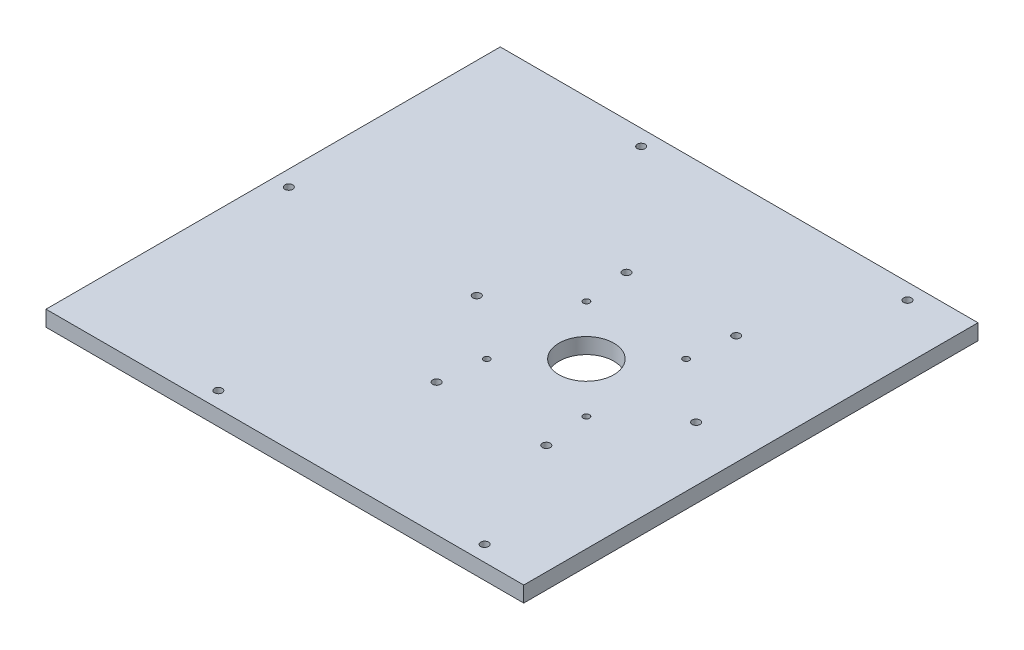
ISO-10303-21;
HEADER;
FILE_DESCRIPTION(('STEP AP214'),'2;1');
FILE_NAME('part.step','',(''),(''),'','','');
FILE_SCHEMA(('AUTOMOTIVE_DESIGN { 1 0 10303 214 1 1 1 1 }'));
ENDSEC;
DATA;
#1=APPLICATION_CONTEXT('core data for automotive mechanical design processes');
#2=APPLICATION_PROTOCOL_DEFINITION('international standard','automotive_design',2000,#1);
#3=PRODUCT_CONTEXT('',#1,'mechanical');
#4=PRODUCT('Part','Part','',(#3));
#5=PRODUCT_RELATED_PRODUCT_CATEGORY('part','',(#4));
#6=PRODUCT_DEFINITION_FORMATION('','',#4);
#7=PRODUCT_DEFINITION_CONTEXT('part definition',#1,'design');
#8=PRODUCT_DEFINITION('design','',#6,#7);
#9=PRODUCT_DEFINITION_SHAPE('','',#8);
#10=(LENGTH_UNIT() NAMED_UNIT(*) SI_UNIT(.MILLI.,.METRE.));
#11=(NAMED_UNIT(*) PLANE_ANGLE_UNIT() SI_UNIT($,.RADIAN.));
#12=(NAMED_UNIT(*) SI_UNIT($,.STERADIAN.) SOLID_ANGLE_UNIT());
#13=UNCERTAINTY_MEASURE_WITH_UNIT(LENGTH_MEASURE(1.E-05),#10,'distance_accuracy_value','');
#14=(GEOMETRIC_REPRESENTATION_CONTEXT(3) GLOBAL_UNCERTAINTY_ASSIGNED_CONTEXT((#13)) GLOBAL_UNIT_ASSIGNED_CONTEXT((#10,
#11,#12)) REPRESENTATION_CONTEXT('',''));
#15=CARTESIAN_POINT('',(0.,0.,0.));
#16=DIRECTION('',(0.,0.,1.));
#17=DIRECTION('',(1.,0.,0.));
#18=AXIS2_PLACEMENT_3D('',#15,#16,#17);
#19=CARTESIAN_POINT('',(0.,10.,0.));
#20=DIRECTION('',(0.,1.,0.));
#21=DIRECTION('',(0.,0.,1.));
#22=AXIS2_PLACEMENT_3D('',#19,#20,#21);
#23=PLANE('',#22);
#24=CARTESIAN_POINT('',(-9.99999999999931,10.,-60.6217782649111));
#25=DIRECTION('',(0.,1.,0.));
#26=DIRECTION('',(0.,0.,1.));
#27=AXIS2_PLACEMENT_3D('',#24,#25,#26);
#28=CIRCLE('',#27,2.50000000000001);
#29=CARTESIAN_POINT('',(-9.99999999999931,10.,-58.1217782649111));
#30=VERTEX_POINT('',#29);
#31=EDGE_CURVE('E193',#30,#30,#28,.T.);
#32=ORIENTED_EDGE('',*,*,#31,.F.);
#33=EDGE_LOOP('',(#32));
#34=FACE_BOUND('',#33,.T.);
#35=CARTESIAN_POINT('',(-75.,10.,-135.));
#36=DIRECTION('',(0.,1.,0.));
#37=DIRECTION('',(0.,0.,1.));
#38=AXIS2_PLACEMENT_3D('',#35,#36,#37);
#39=CIRCLE('',#38,2.5);
#40=CARTESIAN_POINT('',(-75.,10.,-132.5));
#41=VERTEX_POINT('',#40);
#42=EDGE_CURVE('E181',#41,#41,#39,.T.);
#43=ORIENTED_EDGE('',*,*,#42,.F.);
#44=EDGE_LOOP('',(#43));
#45=FACE_BOUND('',#44,.T.);
#46=CARTESIAN_POINT('',(95.0000000000001,10.,135.));
#47=DIRECTION('',(0.,1.,0.));
#48=DIRECTION('',(0.,0.,1.));
#49=AXIS2_PLACEMENT_3D('',#46,#47,#48);
#50=CIRCLE('',#49,2.5);
#51=CARTESIAN_POINT('',(95.0000000000001,10.,137.5));
#52=VERTEX_POINT('',#51);
#53=EDGE_CURVE('E169',#52,#52,#50,.T.);
#54=ORIENTED_EDGE('',*,*,#53,.F.);
#55=EDGE_LOOP('',(#54));
#56=FACE_BOUND('',#55,.T.);
#57=CARTESIAN_POINT('',(-165.,10.,0.));
#58=DIRECTION('',(0.,1.,0.));
#59=DIRECTION('',(0.,0.,1.));
#60=AXIS2_PLACEMENT_3D('',#57,#58,#59);
#61=CIRCLE('',#60,2.5);
#62=CARTESIAN_POINT('',(-165.,10.,2.5));
#63=VERTEX_POINT('',#62);
#64=EDGE_CURVE('E157',#63,#63,#61,.T.);
#65=ORIENTED_EDGE('',*,*,#64,.F.);
#66=EDGE_LOOP('',(#65));
#67=FACE_BOUND('',#66,.T.);
#68=CARTESIAN_POINT('',(-6.81980515339375,10.,31.8198051533952));
#69=DIRECTION('',(0.,1.,0.));
#70=DIRECTION('',(0.,0.,1.));
#71=AXIS2_PLACEMENT_3D('',#68,#69,#70);
#72=CIRCLE('',#71,2.00000000000001);
#73=CARTESIAN_POINT('',(-6.81980515339375,10.,33.8198051533953));
#74=VERTEX_POINT('',#73);
#75=EDGE_CURVE('E145',#74,#74,#72,.T.);
#76=ORIENTED_EDGE('',*,*,#75,.F.);
#77=EDGE_LOOP('',(#76));
#78=FACE_BOUND('',#77,.T.);
#79=CARTESIAN_POINT('',(-10.0000000000002,10.,60.6217782649106));
#80=DIRECTION('',(0.,1.,0.));
#81=DIRECTION('',(0.,0.,1.));
#82=AXIS2_PLACEMENT_3D('',#79,#80,#81);
#83=CIRCLE('',#82,2.50000000000002);
#84=CARTESIAN_POINT('',(-10.0000000000002,10.,63.1217782649106));
#85=VERTEX_POINT('',#84);
#86=EDGE_CURVE('E133',#85,#85,#83,.T.);
#87=ORIENTED_EDGE('',*,*,#86,.F.);
#88=EDGE_LOOP('',(#87));
#89=FACE_BOUND('',#88,.T.);
#90=CARTESIAN_POINT('',(56.8198051533947,10.,-31.8198051533946));
#91=DIRECTION('',(0.,1.,0.));
#92=DIRECTION('',(0.,0.,1.));
#93=AXIS2_PLACEMENT_3D('',#90,#91,#92);
#94=CIRCLE('',#93,2.00000000000001);
#95=CARTESIAN_POINT('',(56.8198051533947,10.,-29.8198051533946));
#96=VERTEX_POINT('',#95);
#97=EDGE_CURVE('E121',#96,#96,#94,.T.);
#98=ORIENTED_EDGE('',*,*,#97,.F.);
#99=EDGE_LOOP('',(#98));
#100=FACE_BOUND('',#99,.T.);
#101=CARTESIAN_POINT('',(25.0000000000001,10.,0.));
#102=DIRECTION('',(0.,1.,0.));
#103=DIRECTION('',(0.,0.,1.));
#104=AXIS2_PLACEMENT_3D('',#101,#102,#103);
#105=CIRCLE('',#104,17.5);
#106=CARTESIAN_POINT('',(25.0000000000001,10.,17.5));
#107=VERTEX_POINT('',#106);
#108=EDGE_CURVE('E100',#107,#107,#105,.T.);
#109=ORIENTED_EDGE('',*,*,#108,.F.);
#110=EDGE_LOOP('',(#109));
#111=FACE_BOUND('',#110,.T.);
#112=DIRECTION('',(0.,0.,1.));
#113=VECTOR('',#112,1.);
#114=CARTESIAN_POINT('',(-175.,10.,-145.));
#115=LINE('',#114,#113);
#116=CARTESIAN_POINT('',(-175.,10.,-145.));
#117=VERTEX_POINT('',#116);
#118=CARTESIAN_POINT('',(-175.,10.,145.));
#119=VERTEX_POINT('',#118);
#120=EDGE_CURVE('E85',#117,#119,#115,.T.);
#121=ORIENTED_EDGE('',*,*,#120,.T.);
#122=DIRECTION('',(1.,0.,0.));
#123=VECTOR('',#122,1.);
#124=CARTESIAN_POINT('',(-175.,10.,145.));
#125=LINE('',#124,#123);
#126=CARTESIAN_POINT('',(130.,10.,145.));
#127=VERTEX_POINT('',#126);
#128=EDGE_CURVE('E80',#119,#127,#125,.T.);
#129=ORIENTED_EDGE('',*,*,#128,.T.);
#130=DIRECTION('',(0.,0.,-1.));
#131=VECTOR('',#130,1.);
#132=CARTESIAN_POINT('',(130.,10.,-145.));
#133=LINE('',#132,#131);
#134=CARTESIAN_POINT('',(130.,10.,-145.));
#135=VERTEX_POINT('',#134);
#136=EDGE_CURVE('E83',#127,#135,#133,.T.);
#137=ORIENTED_EDGE('',*,*,#136,.T.);
#138=DIRECTION('',(-1.,0.,0.));
#139=VECTOR('',#138,1.);
#140=CARTESIAN_POINT('',(-175.,10.,-145.));
#141=LINE('',#140,#139);
#142=EDGE_CURVE('E50',#135,#117,#141,.T.);
#143=ORIENTED_EDGE('',*,*,#142,.T.);
#144=EDGE_LOOP('',(#121,#129,#137,#143));
#145=FACE_BOUND('',#144,.T.);
#146=CARTESIAN_POINT('',(95.0000000000002,10.,0.));
#147=DIRECTION('',(0.,1.,0.));
#148=DIRECTION('',(0.,0.,1.));
#149=AXIS2_PLACEMENT_3D('',#146,#147,#148);
#150=CIRCLE('',#149,2.50000000000001);
#151=CARTESIAN_POINT('',(95.0000000000002,10.,2.50000000000001));
#152=VERTEX_POINT('',#151);
#153=EDGE_CURVE('E115',#152,#152,#150,.T.);
#154=ORIENTED_EDGE('',*,*,#153,.F.);
#155=EDGE_LOOP('',(#154));
#156=FACE_BOUND('',#155,.T.);
#157=CARTESIAN_POINT('',(60.,10.,60.6217782649108));
#158=DIRECTION('',(0.,1.,0.));
#159=DIRECTION('',(0.,0.,1.));
#160=AXIS2_PLACEMENT_3D('',#157,#158,#159);
#161=CIRCLE('',#160,2.5);
#162=CARTESIAN_POINT('',(60.,10.,63.1217782649108));
#163=VERTEX_POINT('',#162);
#164=EDGE_CURVE('E127',#163,#163,#161,.T.);
#165=ORIENTED_EDGE('',*,*,#164,.F.);
#166=EDGE_LOOP('',(#165));
#167=FACE_BOUND('',#166,.T.);
#168=CARTESIAN_POINT('',(56.8198051533955,10.,31.8198051533947));
#169=DIRECTION('',(0.,1.,0.));
#170=DIRECTION('',(0.,0.,1.));
#171=AXIS2_PLACEMENT_3D('',#168,#169,#170);
#172=CIRCLE('',#171,2.00000000000001);
#173=CARTESIAN_POINT('',(56.8198051533955,10.,33.8198051533947));
#174=VERTEX_POINT('',#173);
#175=EDGE_CURVE('E139',#174,#174,#172,.T.);
#176=ORIENTED_EDGE('',*,*,#175,.F.);
#177=EDGE_LOOP('',(#176));
#178=FACE_BOUND('',#177,.T.);
#179=CARTESIAN_POINT('',(-6.81980515339411,10.,-31.819805153394));
#180=DIRECTION('',(0.,1.,0.));
#181=DIRECTION('',(0.,0.,1.));
#182=AXIS2_PLACEMENT_3D('',#179,#180,#181);
#183=CIRCLE('',#182,2.00000000000001);
#184=CARTESIAN_POINT('',(-6.81980515339411,10.,-29.819805153394));
#185=VERTEX_POINT('',#184);
#186=EDGE_CURVE('E151',#185,#185,#183,.T.);
#187=ORIENTED_EDGE('',*,*,#186,.F.);
#188=EDGE_LOOP('',(#187));
#189=FACE_BOUND('',#188,.T.);
#190=CARTESIAN_POINT('',(-75.,10.,135.));
#191=DIRECTION('',(0.,1.,0.));
#192=DIRECTION('',(0.,0.,1.));
#193=AXIS2_PLACEMENT_3D('',#190,#191,#192);
#194=CIRCLE('',#193,2.5);
#195=CARTESIAN_POINT('',(-75.,10.,137.5));
#196=VERTEX_POINT('',#195);
#197=EDGE_CURVE('E163',#196,#196,#194,.T.);
#198=ORIENTED_EDGE('',*,*,#197,.F.);
#199=EDGE_LOOP('',(#198));
#200=FACE_BOUND('',#199,.T.);
#201=CARTESIAN_POINT('',(95.,10.,-135.));
#202=DIRECTION('',(0.,1.,0.));
#203=DIRECTION('',(0.,0.,1.));
#204=AXIS2_PLACEMENT_3D('',#201,#202,#203);
#205=CIRCLE('',#204,2.50000000000001);
#206=CARTESIAN_POINT('',(95.,10.,-132.5));
#207=VERTEX_POINT('',#206);
#208=EDGE_CURVE('E175',#207,#207,#205,.T.);
#209=ORIENTED_EDGE('',*,*,#208,.F.);
#210=EDGE_LOOP('',(#209));
#211=FACE_BOUND('',#210,.T.);
#212=CARTESIAN_POINT('',(-44.9999999999999,10.,-5.04661407728763E-13));
#213=DIRECTION('',(0.,1.,0.));
#214=DIRECTION('',(0.,0.,1.));
#215=AXIS2_PLACEMENT_3D('',#212,#213,#214);
#216=CIRCLE('',#215,2.5);
#217=CARTESIAN_POINT('',(-44.9999999999999,10.,2.4999999999995));
#218=VERTEX_POINT('',#217);
#219=EDGE_CURVE('E187',#218,#218,#216,.T.);
#220=ORIENTED_EDGE('',*,*,#219,.F.);
#221=EDGE_LOOP('',(#220));
#222=FACE_BOUND('',#221,.T.);
#223=CARTESIAN_POINT('',(60.0000000000009,10.,-60.6217782649103));
#224=DIRECTION('',(0.,1.,0.));
#225=DIRECTION('',(0.,0.,1.));
#226=AXIS2_PLACEMENT_3D('',#223,#224,#225);
#227=CIRCLE('',#226,2.50000000000001);
#228=CARTESIAN_POINT('',(60.0000000000009,10.,-58.1217782649103));
#229=VERTEX_POINT('',#228);
#230=EDGE_CURVE('E199',#229,#229,#227,.T.);
#231=ORIENTED_EDGE('',*,*,#230,.F.);
#232=EDGE_LOOP('',(#231));
#233=FACE_BOUND('',#232,.T.);
#234=ADVANCED_FACE('F33',(#34,#45,#56,#67,#78,#89,#100,#111,#145,#156,#167,#178,#189,#200,#211,
#222,#233),#23,.T.);
#235=CARTESIAN_POINT('',(0.,0.,0.));
#236=DIRECTION('',(0.,1.,0.));
#237=DIRECTION('',(0.,0.,1.));
#238=AXIS2_PLACEMENT_3D('',#235,#236,#237);
#239=PLANE('',#238);
#240=DIRECTION('',(0.,0.,1.));
#241=VECTOR('',#240,1.);
#242=CARTESIAN_POINT('',(-175.,0.,-145.));
#243=LINE('',#242,#241);
#244=CARTESIAN_POINT('',(-175.,0.,-145.));
#245=VERTEX_POINT('',#244);
#246=CARTESIAN_POINT('',(-175.,0.,145.));
#247=VERTEX_POINT('',#246);
#248=EDGE_CURVE('E97',#245,#247,#243,.T.);
#249=ORIENTED_EDGE('',*,*,#248,.F.);
#250=DIRECTION('',(-1.,0.,0.));
#251=VECTOR('',#250,1.);
#252=CARTESIAN_POINT('',(-175.,0.,-145.));
#253=LINE('',#252,#251);
#254=CARTESIAN_POINT('',(130.,0.,-145.));
#255=VERTEX_POINT('',#254);
#256=EDGE_CURVE('E73',#255,#245,#253,.T.);
#257=ORIENTED_EDGE('',*,*,#256,.F.);
#258=DIRECTION('',(0.,0.,-1.));
#259=VECTOR('',#258,1.);
#260=CARTESIAN_POINT('',(130.,0.,-145.));
#261=LINE('',#260,#259);
#262=CARTESIAN_POINT('',(130.,0.,145.));
#263=VERTEX_POINT('',#262);
#264=EDGE_CURVE('E67',#263,#255,#261,.T.);
#265=ORIENTED_EDGE('',*,*,#264,.F.);
#266=DIRECTION('',(1.,0.,0.));
#267=VECTOR('',#266,1.);
#268=CARTESIAN_POINT('',(-175.,0.,145.));
#269=LINE('',#268,#267);
#270=EDGE_CURVE('E89',#247,#263,#269,.T.);
#271=ORIENTED_EDGE('',*,*,#270,.F.);
#272=EDGE_LOOP('',(#249,#257,#265,#271));
#273=FACE_BOUND('',#272,.T.);
#274=CARTESIAN_POINT('',(25.0000000000001,0.,0.));
#275=DIRECTION('',(0.,1.,0.));
#276=DIRECTION('',(0.,0.,1.));
#277=AXIS2_PLACEMENT_3D('',#274,#275,#276);
#278=CIRCLE('',#277,17.5);
#279=CARTESIAN_POINT('',(25.0000000000001,0.,17.5));
#280=VERTEX_POINT('',#279);
#281=EDGE_CURVE('E112',#280,#280,#278,.T.);
#282=ORIENTED_EDGE('',*,*,#281,.T.);
#283=EDGE_LOOP('',(#282));
#284=FACE_BOUND('',#283,.T.);
#285=CARTESIAN_POINT('',(95.0000000000002,0.,0.));
#286=DIRECTION('',(0.,1.,0.));
#287=DIRECTION('',(0.,0.,1.));
#288=AXIS2_PLACEMENT_3D('',#285,#286,#287);
#289=CIRCLE('',#288,2.50000000000001);
#290=CARTESIAN_POINT('',(95.0000000000002,0.,2.50000000000001));
#291=VERTEX_POINT('',#290);
#292=EDGE_CURVE('E118',#291,#291,#289,.T.);
#293=ORIENTED_EDGE('',*,*,#292,.T.);
#294=EDGE_LOOP('',(#293));
#295=FACE_BOUND('',#294,.T.);
#296=CARTESIAN_POINT('',(56.8198051533947,0.,-31.8198051533946));
#297=DIRECTION('',(0.,1.,0.));
#298=DIRECTION('',(0.,0.,1.));
#299=AXIS2_PLACEMENT_3D('',#296,#297,#298);
#300=CIRCLE('',#299,2.00000000000001);
#301=CARTESIAN_POINT('',(56.8198051533947,0.,-29.8198051533946));
#302=VERTEX_POINT('',#301);
#303=EDGE_CURVE('E124',#302,#302,#300,.T.);
#304=ORIENTED_EDGE('',*,*,#303,.T.);
#305=EDGE_LOOP('',(#304));
#306=FACE_BOUND('',#305,.T.);
#307=CARTESIAN_POINT('',(60.,0.,60.6217782649108));
#308=DIRECTION('',(0.,1.,0.));
#309=DIRECTION('',(0.,0.,1.));
#310=AXIS2_PLACEMENT_3D('',#307,#308,#309);
#311=CIRCLE('',#310,2.5);
#312=CARTESIAN_POINT('',(60.,0.,63.1217782649108));
#313=VERTEX_POINT('',#312);
#314=EDGE_CURVE('E130',#313,#313,#311,.T.);
#315=ORIENTED_EDGE('',*,*,#314,.T.);
#316=EDGE_LOOP('',(#315));
#317=FACE_BOUND('',#316,.T.);
#318=CARTESIAN_POINT('',(-10.0000000000002,0.,60.6217782649106));
#319=DIRECTION('',(0.,1.,0.));
#320=DIRECTION('',(0.,0.,1.));
#321=AXIS2_PLACEMENT_3D('',#318,#319,#320);
#322=CIRCLE('',#321,2.50000000000002);
#323=CARTESIAN_POINT('',(-10.0000000000002,0.,63.1217782649106));
#324=VERTEX_POINT('',#323);
#325=EDGE_CURVE('E136',#324,#324,#322,.T.);
#326=ORIENTED_EDGE('',*,*,#325,.T.);
#327=EDGE_LOOP('',(#326));
#328=FACE_BOUND('',#327,.T.);
#329=CARTESIAN_POINT('',(56.8198051533955,0.,31.8198051533947));
#330=DIRECTION('',(0.,1.,0.));
#331=DIRECTION('',(0.,0.,1.));
#332=AXIS2_PLACEMENT_3D('',#329,#330,#331);
#333=CIRCLE('',#332,2.00000000000001);
#334=CARTESIAN_POINT('',(56.8198051533955,0.,33.8198051533947));
#335=VERTEX_POINT('',#334);
#336=EDGE_CURVE('E142',#335,#335,#333,.T.);
#337=ORIENTED_EDGE('',*,*,#336,.T.);
#338=EDGE_LOOP('',(#337));
#339=FACE_BOUND('',#338,.T.);
#340=CARTESIAN_POINT('',(-6.81980515339375,0.,31.8198051533952));
#341=DIRECTION('',(0.,1.,0.));
#342=DIRECTION('',(0.,0.,1.));
#343=AXIS2_PLACEMENT_3D('',#340,#341,#342);
#344=CIRCLE('',#343,2.00000000000001);
#345=CARTESIAN_POINT('',(-6.81980515339375,0.,33.8198051533953));
#346=VERTEX_POINT('',#345);
#347=EDGE_CURVE('E148',#346,#346,#344,.T.);
#348=ORIENTED_EDGE('',*,*,#347,.T.);
#349=EDGE_LOOP('',(#348));
#350=FACE_BOUND('',#349,.T.);
#351=CARTESIAN_POINT('',(-6.81980515339411,0.,-31.819805153394));
#352=DIRECTION('',(0.,1.,0.));
#353=DIRECTION('',(0.,0.,1.));
#354=AXIS2_PLACEMENT_3D('',#351,#352,#353);
#355=CIRCLE('',#354,2.00000000000001);
#356=CARTESIAN_POINT('',(-6.81980515339411,0.,-29.819805153394));
#357=VERTEX_POINT('',#356);
#358=EDGE_CURVE('E154',#357,#357,#355,.T.);
#359=ORIENTED_EDGE('',*,*,#358,.T.);
#360=EDGE_LOOP('',(#359));
#361=FACE_BOUND('',#360,.T.);
#362=CARTESIAN_POINT('',(-165.,0.,0.));
#363=DIRECTION('',(0.,1.,0.));
#364=DIRECTION('',(0.,0.,1.));
#365=AXIS2_PLACEMENT_3D('',#362,#363,#364);
#366=CIRCLE('',#365,2.5);
#367=CARTESIAN_POINT('',(-165.,0.,2.5));
#368=VERTEX_POINT('',#367);
#369=EDGE_CURVE('E160',#368,#368,#366,.T.);
#370=ORIENTED_EDGE('',*,*,#369,.T.);
#371=EDGE_LOOP('',(#370));
#372=FACE_BOUND('',#371,.T.);
#373=CARTESIAN_POINT('',(-75.,0.,135.));
#374=DIRECTION('',(0.,1.,0.));
#375=DIRECTION('',(0.,0.,1.));
#376=AXIS2_PLACEMENT_3D('',#373,#374,#375);
#377=CIRCLE('',#376,2.5);
#378=CARTESIAN_POINT('',(-75.,0.,137.5));
#379=VERTEX_POINT('',#378);
#380=EDGE_CURVE('E166',#379,#379,#377,.T.);
#381=ORIENTED_EDGE('',*,*,#380,.T.);
#382=EDGE_LOOP('',(#381));
#383=FACE_BOUND('',#382,.T.);
#384=CARTESIAN_POINT('',(95.0000000000001,0.,135.));
#385=DIRECTION('',(0.,1.,0.));
#386=DIRECTION('',(0.,0.,1.));
#387=AXIS2_PLACEMENT_3D('',#384,#385,#386);
#388=CIRCLE('',#387,2.5);
#389=CARTESIAN_POINT('',(95.0000000000001,0.,137.5));
#390=VERTEX_POINT('',#389);
#391=EDGE_CURVE('E172',#390,#390,#388,.T.);
#392=ORIENTED_EDGE('',*,*,#391,.T.);
#393=EDGE_LOOP('',(#392));
#394=FACE_BOUND('',#393,.T.);
#395=CARTESIAN_POINT('',(95.,0.,-135.));
#396=DIRECTION('',(0.,1.,0.));
#397=DIRECTION('',(0.,0.,1.));
#398=AXIS2_PLACEMENT_3D('',#395,#396,#397);
#399=CIRCLE('',#398,2.50000000000001);
#400=CARTESIAN_POINT('',(95.,0.,-132.5));
#401=VERTEX_POINT('',#400);
#402=EDGE_CURVE('E178',#401,#401,#399,.T.);
#403=ORIENTED_EDGE('',*,*,#402,.T.);
#404=EDGE_LOOP('',(#403));
#405=FACE_BOUND('',#404,.T.);
#406=CARTESIAN_POINT('',(-75.,0.,-135.));
#407=DIRECTION('',(0.,1.,0.));
#408=DIRECTION('',(0.,0.,1.));
#409=AXIS2_PLACEMENT_3D('',#406,#407,#408);
#410=CIRCLE('',#409,2.5);
#411=CARTESIAN_POINT('',(-75.,0.,-132.5));
#412=VERTEX_POINT('',#411);
#413=EDGE_CURVE('E184',#412,#412,#410,.T.);
#414=ORIENTED_EDGE('',*,*,#413,.T.);
#415=EDGE_LOOP('',(#414));
#416=FACE_BOUND('',#415,.T.);
#417=CARTESIAN_POINT('',(-44.9999999999999,0.,-5.04661407728763E-13));
#418=DIRECTION('',(0.,1.,0.));
#419=DIRECTION('',(0.,0.,1.));
#420=AXIS2_PLACEMENT_3D('',#417,#418,#419);
#421=CIRCLE('',#420,2.5);
#422=CARTESIAN_POINT('',(-44.9999999999999,0.,2.4999999999995));
#423=VERTEX_POINT('',#422);
#424=EDGE_CURVE('E190',#423,#423,#421,.T.);
#425=ORIENTED_EDGE('',*,*,#424,.T.);
#426=EDGE_LOOP('',(#425));
#427=FACE_BOUND('',#426,.T.);
#428=CARTESIAN_POINT('',(-9.99999999999931,0.,-60.6217782649111));
#429=DIRECTION('',(0.,1.,0.));
#430=DIRECTION('',(0.,0.,1.));
#431=AXIS2_PLACEMENT_3D('',#428,#429,#430);
#432=CIRCLE('',#431,2.50000000000001);
#433=CARTESIAN_POINT('',(-9.99999999999931,0.,-58.1217782649111));
#434=VERTEX_POINT('',#433);
#435=EDGE_CURVE('E196',#434,#434,#432,.T.);
#436=ORIENTED_EDGE('',*,*,#435,.T.);
#437=EDGE_LOOP('',(#436));
#438=FACE_BOUND('',#437,.T.);
#439=CARTESIAN_POINT('',(60.0000000000009,0.,-60.6217782649103));
#440=DIRECTION('',(0.,1.,0.));
#441=DIRECTION('',(0.,0.,1.));
#442=AXIS2_PLACEMENT_3D('',#439,#440,#441);
#443=CIRCLE('',#442,2.50000000000001);
#444=CARTESIAN_POINT('',(60.0000000000009,0.,-58.1217782649103));
#445=VERTEX_POINT('',#444);
#446=EDGE_CURVE('E202',#445,#445,#443,.T.);
#447=ORIENTED_EDGE('',*,*,#446,.T.);
#448=EDGE_LOOP('',(#447));
#449=FACE_BOUND('',#448,.T.);
#450=ADVANCED_FACE('F108',(#273,#284,#295,#306,#317,#328,#339,#350,#361,#372,#383,#394,#405,
#416,#427,#438,#449),#239,.F.);
#451=CARTESIAN_POINT('',(-175.,10.,-145.));
#452=DIRECTION('',(1.,0.,0.));
#453=DIRECTION('',(0.,0.,-1.));
#454=AXIS2_PLACEMENT_3D('',#451,#452,#453);
#455=PLANE('',#454);
#456=ORIENTED_EDGE('',*,*,#248,.T.);
#457=DIRECTION('',(0.,-1.,0.));
#458=VECTOR('',#457,1.);
#459=CARTESIAN_POINT('',(-175.,10.,145.));
#460=LINE('',#459,#458);
#461=EDGE_CURVE('E11',#119,#247,#460,.T.);
#462=ORIENTED_EDGE('',*,*,#461,.F.);
#463=ORIENTED_EDGE('',*,*,#120,.F.);
#464=DIRECTION('',(0.,-1.,0.));
#465=VECTOR('',#464,1.);
#466=CARTESIAN_POINT('',(-175.,10.,-145.));
#467=LINE('',#466,#465);
#468=EDGE_CURVE('E93',#117,#245,#467,.T.);
#469=ORIENTED_EDGE('',*,*,#468,.T.);
#470=EDGE_LOOP('',(#456,#462,#463,#469));
#471=FACE_BOUND('',#470,.T.);
#472=ADVANCED_FACE('F35',(#471),#455,.F.);
#473=CARTESIAN_POINT('',(-175.,10.,145.));
#474=DIRECTION('',(0.,0.,-1.));
#475=DIRECTION('',(-1.,0.,0.));
#476=AXIS2_PLACEMENT_3D('',#473,#474,#475);
#477=PLANE('',#476);
#478=ORIENTED_EDGE('',*,*,#270,.T.);
#479=DIRECTION('',(0.,-1.,0.));
#480=VECTOR('',#479,1.);
#481=CARTESIAN_POINT('',(130.,10.,145.));
#482=LINE('',#481,#480);
#483=EDGE_CURVE('E42',#127,#263,#482,.T.);
#484=ORIENTED_EDGE('',*,*,#483,.F.);
#485=ORIENTED_EDGE('',*,*,#128,.F.);
#486=ORIENTED_EDGE('',*,*,#461,.T.);
#487=EDGE_LOOP('',(#478,#484,#485,#486));
#488=FACE_BOUND('',#487,.T.);
#489=ADVANCED_FACE('F88',(#488),#477,.F.);
#490=CARTESIAN_POINT('',(130.,10.,-145.));
#491=DIRECTION('',(-1.,0.,0.));
#492=DIRECTION('',(0.,0.,1.));
#493=AXIS2_PLACEMENT_3D('',#490,#491,#492);
#494=PLANE('',#493);
#495=ORIENTED_EDGE('',*,*,#264,.T.);
#496=DIRECTION('',(0.,-1.,0.));
#497=VECTOR('',#496,1.);
#498=CARTESIAN_POINT('',(130.,10.,-145.));
#499=LINE('',#498,#497);
#500=EDGE_CURVE('E90',#135,#255,#499,.T.);
#501=ORIENTED_EDGE('',*,*,#500,.F.);
#502=ORIENTED_EDGE('',*,*,#136,.F.);
#503=ORIENTED_EDGE('',*,*,#483,.T.);
#504=EDGE_LOOP('',(#495,#501,#502,#503));
#505=FACE_BOUND('',#504,.T.);
#506=ADVANCED_FACE('F91',(#505),#494,.F.);
#507=CARTESIAN_POINT('',(-175.,10.,-145.));
#508=DIRECTION('',(0.,0.,1.));
#509=DIRECTION('',(1.,0.,0.));
#510=AXIS2_PLACEMENT_3D('',#507,#508,#509);
#511=PLANE('',#510);
#512=ORIENTED_EDGE('',*,*,#256,.T.);
#513=ORIENTED_EDGE('',*,*,#468,.F.);
#514=ORIENTED_EDGE('',*,*,#142,.F.);
#515=ORIENTED_EDGE('',*,*,#500,.T.);
#516=EDGE_LOOP('',(#512,#513,#514,#515));
#517=FACE_BOUND('',#516,.T.);
#518=ADVANCED_FACE('F105',(#517),#511,.F.);
#519=CARTESIAN_POINT('',(25.0000000000001,10.,0.));
#520=DIRECTION('',(0.,-1.,0.));
#521=DIRECTION('',(0.,0.,-1.));
#522=AXIS2_PLACEMENT_3D('',#519,#520,#521);
#523=CYLINDRICAL_SURFACE('',#522,17.5);
#524=ORIENTED_EDGE('',*,*,#108,.T.);
#525=EDGE_LOOP('',(#524));
#526=FACE_BOUND('',#525,.T.);
#527=ORIENTED_EDGE('',*,*,#281,.F.);
#528=EDGE_LOOP('',(#527));
#529=FACE_BOUND('',#528,.T.);
#530=ADVANCED_FACE('F221',(#526,#529),#523,.F.);
#531=CARTESIAN_POINT('',(95.0000000000002,10.,0.));
#532=DIRECTION('',(0.,-1.,0.));
#533=DIRECTION('',(0.,0.,-1.));
#534=AXIS2_PLACEMENT_3D('',#531,#532,#533);
#535=CYLINDRICAL_SURFACE('',#534,2.50000000000001);
#536=ORIENTED_EDGE('',*,*,#153,.T.);
#537=EDGE_LOOP('',(#536));
#538=FACE_BOUND('',#537,.T.);
#539=ORIENTED_EDGE('',*,*,#292,.F.);
#540=EDGE_LOOP('',(#539));
#541=FACE_BOUND('',#540,.T.);
#542=ADVANCED_FACE('F267',(#538,#541),#535,.F.);
#543=CARTESIAN_POINT('',(56.8198051533947,10.,-31.8198051533946));
#544=DIRECTION('',(0.,-1.,0.));
#545=DIRECTION('',(0.,0.,-1.));
#546=AXIS2_PLACEMENT_3D('',#543,#544,#545);
#547=CYLINDRICAL_SURFACE('',#546,2.00000000000001);
#548=ORIENTED_EDGE('',*,*,#97,.T.);
#549=EDGE_LOOP('',(#548));
#550=FACE_BOUND('',#549,.T.);
#551=ORIENTED_EDGE('',*,*,#303,.F.);
#552=EDGE_LOOP('',(#551));
#553=FACE_BOUND('',#552,.T.);
#554=ADVANCED_FACE('F275',(#550,#553),#547,.F.);
#555=CARTESIAN_POINT('',(60.,10.,60.6217782649108));
#556=DIRECTION('',(0.,-1.,0.));
#557=DIRECTION('',(0.,0.,-1.));
#558=AXIS2_PLACEMENT_3D('',#555,#556,#557);
#559=CYLINDRICAL_SURFACE('',#558,2.5);
#560=ORIENTED_EDGE('',*,*,#164,.T.);
#561=EDGE_LOOP('',(#560));
#562=FACE_BOUND('',#561,.T.);
#563=ORIENTED_EDGE('',*,*,#314,.F.);
#564=EDGE_LOOP('',(#563));
#565=FACE_BOUND('',#564,.T.);
#566=ADVANCED_FACE('F283',(#562,#565),#559,.F.);
#567=CARTESIAN_POINT('',(-10.0000000000002,10.,60.6217782649106));
#568=DIRECTION('',(0.,-1.,0.));
#569=DIRECTION('',(0.,0.,-1.));
#570=AXIS2_PLACEMENT_3D('',#567,#568,#569);
#571=CYLINDRICAL_SURFACE('',#570,2.50000000000002);
#572=ORIENTED_EDGE('',*,*,#86,.T.);
#573=EDGE_LOOP('',(#572));
#574=FACE_BOUND('',#573,.T.);
#575=ORIENTED_EDGE('',*,*,#325,.F.);
#576=EDGE_LOOP('',(#575));
#577=FACE_BOUND('',#576,.T.);
#578=ADVANCED_FACE('F292',(#574,#577),#571,.F.);
#579=CARTESIAN_POINT('',(56.8198051533955,10.,31.8198051533947));
#580=DIRECTION('',(0.,-1.,0.));
#581=DIRECTION('',(0.,0.,-1.));
#582=AXIS2_PLACEMENT_3D('',#579,#580,#581);
#583=CYLINDRICAL_SURFACE('',#582,2.00000000000001);
#584=ORIENTED_EDGE('',*,*,#175,.T.);
#585=EDGE_LOOP('',(#584));
#586=FACE_BOUND('',#585,.T.);
#587=ORIENTED_EDGE('',*,*,#336,.F.);
#588=EDGE_LOOP('',(#587));
#589=FACE_BOUND('',#588,.T.);
#590=ADVANCED_FACE('F301',(#586,#589),#583,.F.);
#591=CARTESIAN_POINT('',(-6.81980515339375,10.,31.8198051533952));
#592=DIRECTION('',(0.,-1.,0.));
#593=DIRECTION('',(0.,0.,-1.));
#594=AXIS2_PLACEMENT_3D('',#591,#592,#593);
#595=CYLINDRICAL_SURFACE('',#594,2.00000000000001);
#596=ORIENTED_EDGE('',*,*,#75,.T.);
#597=EDGE_LOOP('',(#596));
#598=FACE_BOUND('',#597,.T.);
#599=ORIENTED_EDGE('',*,*,#347,.F.);
#600=EDGE_LOOP('',(#599));
#601=FACE_BOUND('',#600,.T.);
#602=ADVANCED_FACE('F310',(#598,#601),#595,.F.);
#603=CARTESIAN_POINT('',(-6.81980515339411,10.,-31.819805153394));
#604=DIRECTION('',(0.,-1.,0.));
#605=DIRECTION('',(0.,0.,-1.));
#606=AXIS2_PLACEMENT_3D('',#603,#604,#605);
#607=CYLINDRICAL_SURFACE('',#606,2.00000000000001);
#608=ORIENTED_EDGE('',*,*,#186,.T.);
#609=EDGE_LOOP('',(#608));
#610=FACE_BOUND('',#609,.T.);
#611=ORIENTED_EDGE('',*,*,#358,.F.);
#612=EDGE_LOOP('',(#611));
#613=FACE_BOUND('',#612,.T.);
#614=ADVANCED_FACE('F319',(#610,#613),#607,.F.);
#615=CARTESIAN_POINT('',(-165.,10.,0.));
#616=DIRECTION('',(0.,-1.,0.));
#617=DIRECTION('',(0.,0.,-1.));
#618=AXIS2_PLACEMENT_3D('',#615,#616,#617);
#619=CYLINDRICAL_SURFACE('',#618,2.5);
#620=ORIENTED_EDGE('',*,*,#64,.T.);
#621=EDGE_LOOP('',(#620));
#622=FACE_BOUND('',#621,.T.);
#623=ORIENTED_EDGE('',*,*,#369,.F.);
#624=EDGE_LOOP('',(#623));
#625=FACE_BOUND('',#624,.T.);
#626=ADVANCED_FACE('F328',(#622,#625),#619,.F.);
#627=CARTESIAN_POINT('',(-75.,10.,135.));
#628=DIRECTION('',(0.,-1.,0.));
#629=DIRECTION('',(0.,0.,-1.));
#630=AXIS2_PLACEMENT_3D('',#627,#628,#629);
#631=CYLINDRICAL_SURFACE('',#630,2.5);
#632=ORIENTED_EDGE('',*,*,#197,.T.);
#633=EDGE_LOOP('',(#632));
#634=FACE_BOUND('',#633,.T.);
#635=ORIENTED_EDGE('',*,*,#380,.F.);
#636=EDGE_LOOP('',(#635));
#637=FACE_BOUND('',#636,.T.);
#638=ADVANCED_FACE('F337',(#634,#637),#631,.F.);
#639=CARTESIAN_POINT('',(95.0000000000001,10.,135.));
#640=DIRECTION('',(0.,-1.,0.));
#641=DIRECTION('',(0.,0.,-1.));
#642=AXIS2_PLACEMENT_3D('',#639,#640,#641);
#643=CYLINDRICAL_SURFACE('',#642,2.5);
#644=ORIENTED_EDGE('',*,*,#53,.T.);
#645=EDGE_LOOP('',(#644));
#646=FACE_BOUND('',#645,.T.);
#647=ORIENTED_EDGE('',*,*,#391,.F.);
#648=EDGE_LOOP('',(#647));
#649=FACE_BOUND('',#648,.T.);
#650=ADVANCED_FACE('F346',(#646,#649),#643,.F.);
#651=CARTESIAN_POINT('',(95.,10.,-135.));
#652=DIRECTION('',(0.,-1.,0.));
#653=DIRECTION('',(0.,0.,-1.));
#654=AXIS2_PLACEMENT_3D('',#651,#652,#653);
#655=CYLINDRICAL_SURFACE('',#654,2.50000000000001);
#656=ORIENTED_EDGE('',*,*,#208,.T.);
#657=EDGE_LOOP('',(#656));
#658=FACE_BOUND('',#657,.T.);
#659=ORIENTED_EDGE('',*,*,#402,.F.);
#660=EDGE_LOOP('',(#659));
#661=FACE_BOUND('',#660,.T.);
#662=ADVANCED_FACE('F355',(#658,#661),#655,.F.);
#663=CARTESIAN_POINT('',(-75.,10.,-135.));
#664=DIRECTION('',(0.,-1.,0.));
#665=DIRECTION('',(0.,0.,-1.));
#666=AXIS2_PLACEMENT_3D('',#663,#664,#665);
#667=CYLINDRICAL_SURFACE('',#666,2.5);
#668=ORIENTED_EDGE('',*,*,#42,.T.);
#669=EDGE_LOOP('',(#668));
#670=FACE_BOUND('',#669,.T.);
#671=ORIENTED_EDGE('',*,*,#413,.F.);
#672=EDGE_LOOP('',(#671));
#673=FACE_BOUND('',#672,.T.);
#674=ADVANCED_FACE('F364',(#670,#673),#667,.F.);
#675=CARTESIAN_POINT('',(-44.9999999999999,10.,-5.04661407728763E-13));
#676=DIRECTION('',(0.,-1.,0.));
#677=DIRECTION('',(0.,0.,-1.));
#678=AXIS2_PLACEMENT_3D('',#675,#676,#677);
#679=CYLINDRICAL_SURFACE('',#678,2.5);
#680=ORIENTED_EDGE('',*,*,#219,.T.);
#681=EDGE_LOOP('',(#680));
#682=FACE_BOUND('',#681,.T.);
#683=ORIENTED_EDGE('',*,*,#424,.F.);
#684=EDGE_LOOP('',(#683));
#685=FACE_BOUND('',#684,.T.);
#686=ADVANCED_FACE('F373',(#682,#685),#679,.F.);
#687=CARTESIAN_POINT('',(-9.99999999999931,10.,-60.6217782649111));
#688=DIRECTION('',(0.,-1.,0.));
#689=DIRECTION('',(0.,0.,-1.));
#690=AXIS2_PLACEMENT_3D('',#687,#688,#689);
#691=CYLINDRICAL_SURFACE('',#690,2.50000000000001);
#692=ORIENTED_EDGE('',*,*,#31,.T.);
#693=EDGE_LOOP('',(#692));
#694=FACE_BOUND('',#693,.T.);
#695=ORIENTED_EDGE('',*,*,#435,.F.);
#696=EDGE_LOOP('',(#695));
#697=FACE_BOUND('',#696,.T.);
#698=ADVANCED_FACE('F382',(#694,#697),#691,.F.);
#699=CARTESIAN_POINT('',(60.0000000000009,10.,-60.6217782649103));
#700=DIRECTION('',(0.,-1.,0.));
#701=DIRECTION('',(0.,0.,-1.));
#702=AXIS2_PLACEMENT_3D('',#699,#700,#701);
#703=CYLINDRICAL_SURFACE('',#702,2.50000000000001);
#704=ORIENTED_EDGE('',*,*,#230,.T.);
#705=EDGE_LOOP('',(#704));
#706=FACE_BOUND('',#705,.T.);
#707=ORIENTED_EDGE('',*,*,#446,.F.);
#708=EDGE_LOOP('',(#707));
#709=FACE_BOUND('',#708,.T.);
#710=ADVANCED_FACE('F208',(#706,#709),#703,.F.);
#711=CLOSED_SHELL('',(#234,#450,#472,#489,#506,#518,#530,#542,#554,#566,#578,#590,#602,#614,
#626,#638,#650,#662,#674,#686,#698,#710));
#712=MANIFOLD_SOLID_BREP('B2',#711);
#713=ADVANCED_BREP_SHAPE_REPRESENTATION('',(#18,#712),#14);
#714=SHAPE_DEFINITION_REPRESENTATION(#9,#713);
ENDSEC;
END-ISO-10303-21;
